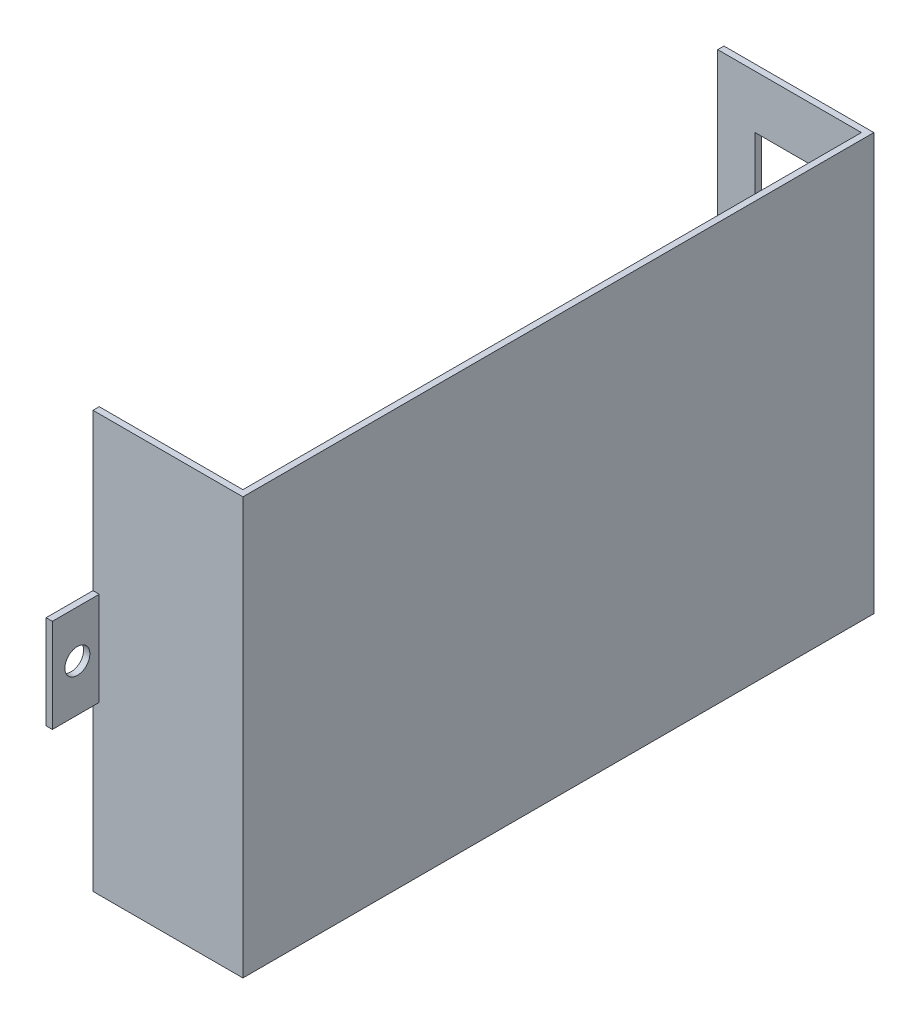
ISO-10303-21;
HEADER;
FILE_DESCRIPTION(('STEP AP214'),'2;1');
FILE_NAME('part.step','',(''),(''),'','','');
FILE_SCHEMA(('AUTOMOTIVE_DESIGN { 1 0 10303 214 1 1 1 1 }'));
ENDSEC;
DATA;
#1=APPLICATION_CONTEXT('core data for automotive mechanical design processes');
#2=APPLICATION_PROTOCOL_DEFINITION('international standard','automotive_design',2000,#1);
#3=PRODUCT_CONTEXT('',#1,'mechanical');
#4=PRODUCT('Part','Part','',(#3));
#5=PRODUCT_RELATED_PRODUCT_CATEGORY('part','',(#4));
#6=PRODUCT_DEFINITION_FORMATION('','',#4);
#7=PRODUCT_DEFINITION_CONTEXT('part definition',#1,'design');
#8=PRODUCT_DEFINITION('design','',#6,#7);
#9=PRODUCT_DEFINITION_SHAPE('','',#8);
#10=(LENGTH_UNIT() NAMED_UNIT(*) SI_UNIT(.MILLI.,.METRE.));
#11=(NAMED_UNIT(*) PLANE_ANGLE_UNIT() SI_UNIT($,.RADIAN.));
#12=(NAMED_UNIT(*) SI_UNIT($,.STERADIAN.) SOLID_ANGLE_UNIT());
#13=UNCERTAINTY_MEASURE_WITH_UNIT(LENGTH_MEASURE(1.E-05),#10,'distance_accuracy_value','');
#14=(GEOMETRIC_REPRESENTATION_CONTEXT(3) GLOBAL_UNCERTAINTY_ASSIGNED_CONTEXT((#13)) GLOBAL_UNIT_ASSIGNED_CONTEXT((#10,
#11,#12)) REPRESENTATION_CONTEXT('',''));
#15=CARTESIAN_POINT('',(0.,0.,0.));
#16=DIRECTION('',(0.,0.,1.));
#17=DIRECTION('',(1.,0.,0.));
#18=AXIS2_PLACEMENT_3D('',#15,#16,#17);
#19=CARTESIAN_POINT('',(2.5,-1.25,0.));
#20=DIRECTION('',(1.,0.,0.));
#21=DIRECTION('',(0.,1.,0.));
#22=AXIS2_PLACEMENT_3D('',#19,#20,#21);
#23=PLANE('',#22);
#24=CARTESIAN_POINT('',(2.5,-0.400000000000009,54.0000008642673));
#25=DIRECTION('',(-1.,0.,0.));
#26=DIRECTION('',(0.,0.,-1.));
#27=AXIS2_PLACEMENT_3D('',#24,#25,#26);
#28=CIRCLE('',#27,2.);
#29=CARTESIAN_POINT('',(2.5,-0.40000000000001,56.0000008642673));
#30=VERTEX_POINT('',#29);
#31=EDGE_CURVE('E454',#30,#30,#28,.T.);
#32=ORIENTED_EDGE('',*,*,#31,.F.);
#33=EDGE_LOOP('',(#32));
#34=FACE_BOUND('',#33,.T.);
#35=CARTESIAN_POINT('',(2.5,-0.400000000000009,-54.0000008642673));
#36=DIRECTION('',(-1.,0.,0.));
#37=DIRECTION('',(0.,0.,-1.));
#38=AXIS2_PLACEMENT_3D('',#35,#36,#37);
#39=CIRCLE('',#38,2.);
#40=CARTESIAN_POINT('',(2.5,-0.40000000000001,-52.0000008642673));
#41=VERTEX_POINT('',#40);
#42=EDGE_CURVE('E332',#41,#41,#39,.T.);
#43=ORIENTED_EDGE('',*,*,#42,.F.);
#44=EDGE_LOOP('',(#43));
#45=FACE_BOUND('',#44,.T.);
#46=DIRECTION('',(0.,1.,0.));
#47=VECTOR('',#46,1.);
#48=CARTESIAN_POINT('',(2.5,-17.925,-49.5));
#49=LINE('',#48,#47);
#50=CARTESIAN_POINT('',(2.5,-33.6,-49.5));
#51=VERTEX_POINT('',#50);
#52=CARTESIAN_POINT('',(2.5,32.1,-49.5));
#53=VERTEX_POINT('',#52);
#54=EDGE_CURVE('E258',#51,#53,#49,.T.);
#55=ORIENTED_EDGE('',*,*,#54,.T.);
#56=DIRECTION('',(0.,0.,1.));
#57=VECTOR('',#56,1.);
#58=CARTESIAN_POINT('',(2.5,32.1,-50.5));
#59=LINE('',#58,#57);
#60=CARTESIAN_POINT('',(2.5,32.1,-50.5));
#61=VERTEX_POINT('',#60);
#62=EDGE_CURVE('E354',#61,#53,#59,.T.);
#63=ORIENTED_EDGE('',*,*,#62,.F.);
#64=DIRECTION('',(0.,1.,0.));
#65=VECTOR('',#64,1.);
#66=CARTESIAN_POINT('',(2.5,-34.6,-50.5));
#67=LINE('',#66,#65);
#68=CARTESIAN_POINT('',(2.5,7.1,-50.5));
#69=VERTEX_POINT('',#68);
#70=EDGE_CURVE('E347',#69,#61,#67,.T.);
#71=ORIENTED_EDGE('',*,*,#70,.F.);
#72=DIRECTION('',(0.,0.,-1.));
#73=VECTOR('',#72,1.);
#74=CARTESIAN_POINT('',(2.5,7.1,-50.5));
#75=LINE('',#74,#73);
#76=CARTESIAN_POINT('',(2.5,7.1,-58.0000008642673));
#77=VERTEX_POINT('',#76);
#78=EDGE_CURVE('E327',#69,#77,#75,.T.);
#79=ORIENTED_EDGE('',*,*,#78,.T.);
#80=DIRECTION('',(0.,1.,0.));
#81=VECTOR('',#80,1.);
#82=CARTESIAN_POINT('',(2.5,-7.9,-58.0000008642673));
#83=LINE('',#82,#81);
#84=CARTESIAN_POINT('',(2.5,-7.9,-58.0000008642673));
#85=VERTEX_POINT('',#84);
#86=EDGE_CURVE('E474',#85,#77,#83,.T.);
#87=ORIENTED_EDGE('',*,*,#86,.F.);
#88=DIRECTION('',(0.,0.,-1.));
#89=VECTOR('',#88,1.);
#90=CARTESIAN_POINT('',(2.5,-7.9,-50.5));
#91=LINE('',#90,#89);
#92=CARTESIAN_POINT('',(2.5,-7.9,-50.5));
#93=VERTEX_POINT('',#92);
#94=EDGE_CURVE('E309',#93,#85,#91,.T.);
#95=ORIENTED_EDGE('',*,*,#94,.F.);
#96=DIRECTION('',(0.,1.,0.));
#97=VECTOR('',#96,1.);
#98=CARTESIAN_POINT('',(2.5,-34.6,-50.5));
#99=LINE('',#98,#97);
#100=CARTESIAN_POINT('',(2.5,-34.6,-50.5));
#101=VERTEX_POINT('',#100);
#102=EDGE_CURVE('E376',#101,#93,#99,.T.);
#103=ORIENTED_EDGE('',*,*,#102,.F.);
#104=DIRECTION('',(0.,0.,-1.));
#105=VECTOR('',#104,1.);
#106=CARTESIAN_POINT('',(2.5,-34.6,50.5));
#107=LINE('',#106,#105);
#108=CARTESIAN_POINT('',(2.5,-34.6,50.5));
#109=VERTEX_POINT('',#108);
#110=EDGE_CURVE('E28',#109,#101,#107,.T.);
#111=ORIENTED_EDGE('',*,*,#110,.F.);
#112=DIRECTION('',(0.,-1.,0.));
#113=VECTOR('',#112,1.);
#114=CARTESIAN_POINT('',(2.5,32.1,50.5));
#115=LINE('',#114,#113);
#116=CARTESIAN_POINT('',(2.5,-7.9,50.5));
#117=VERTEX_POINT('',#116);
#118=EDGE_CURVE('E518',#117,#109,#115,.T.);
#119=ORIENTED_EDGE('',*,*,#118,.F.);
#120=DIRECTION('',(0.,0.,-1.));
#121=VECTOR('',#120,1.);
#122=CARTESIAN_POINT('',(2.5,-7.9,58.0000008642673));
#123=LINE('',#122,#121);
#124=CARTESIAN_POINT('',(2.5,-7.9,58.0000008642673));
#125=VERTEX_POINT('',#124);
#126=EDGE_CURVE('E339',#125,#117,#123,.T.);
#127=ORIENTED_EDGE('',*,*,#126,.F.);
#128=DIRECTION('',(0.,-1.,0.));
#129=VECTOR('',#128,1.);
#130=CARTESIAN_POINT('',(2.5,7.1,58.0000008642673));
#131=LINE('',#130,#129);
#132=CARTESIAN_POINT('',(2.5,7.1,58.0000008642673));
#133=VERTEX_POINT('',#132);
#134=EDGE_CURVE('E402',#133,#125,#131,.T.);
#135=ORIENTED_EDGE('',*,*,#134,.F.);
#136=DIRECTION('',(0.,0.,1.));
#137=VECTOR('',#136,1.);
#138=CARTESIAN_POINT('',(2.5,7.1,50.5));
#139=LINE('',#138,#137);
#140=CARTESIAN_POINT('',(2.5,7.1,50.5));
#141=VERTEX_POINT('',#140);
#142=EDGE_CURVE('E433',#141,#133,#139,.T.);
#143=ORIENTED_EDGE('',*,*,#142,.F.);
#144=DIRECTION('',(0.,-1.,0.));
#145=VECTOR('',#144,1.);
#146=CARTESIAN_POINT('',(2.5,32.1,50.5));
#147=LINE('',#146,#145);
#148=CARTESIAN_POINT('',(2.5,32.1,50.5));
#149=VERTEX_POINT('',#148);
#150=EDGE_CURVE('E351',#149,#141,#147,.T.);
#151=ORIENTED_EDGE('',*,*,#150,.F.);
#152=DIRECTION('',(0.,0.,1.));
#153=VECTOR('',#152,1.);
#154=CARTESIAN_POINT('',(2.5,32.1,-50.5));
#155=LINE('',#154,#153);
#156=CARTESIAN_POINT('',(2.5,32.1,49.5));
#157=VERTEX_POINT('',#156);
#158=EDGE_CURVE('E507',#157,#149,#155,.T.);
#159=ORIENTED_EDGE('',*,*,#158,.F.);
#160=DIRECTION('',(0.,-1.,0.));
#161=VECTOR('',#160,1.);
#162=CARTESIAN_POINT('',(2.5,15.425,49.5));
#163=LINE('',#162,#161);
#164=CARTESIAN_POINT('',(2.5,-33.6,49.5));
#165=VERTEX_POINT('',#164);
#166=EDGE_CURVE('E279',#157,#165,#163,.T.);
#167=ORIENTED_EDGE('',*,*,#166,.T.);
#168=DIRECTION('',(0.,0.,-1.));
#169=VECTOR('',#168,1.);
#170=CARTESIAN_POINT('',(2.5,-33.6,25.25));
#171=LINE('',#170,#169);
#172=EDGE_CURVE('E275',#165,#51,#171,.T.);
#173=ORIENTED_EDGE('',*,*,#172,.T.);
#174=EDGE_LOOP('',(#55,#63,#71,#79,#87,#95,#103,#111,#119,#127,#135,#143,#151,#159,#167,#173));
#175=FACE_BOUND('',#174,.T.);
#176=ADVANCED_FACE('F17',(#34,#45,#175),#23,.F.);
#177=CARTESIAN_POINT('',(26.5,-1.25,0.));
#178=DIRECTION('',(1.,0.,0.));
#179=DIRECTION('',(0.,1.,0.));
#180=AXIS2_PLACEMENT_3D('',#177,#178,#179);
#181=PLANE('',#180);
#182=DIRECTION('',(0.,1.,0.));
#183=VECTOR('',#182,1.);
#184=CARTESIAN_POINT('',(26.5,-34.6,-50.5));
#185=LINE('',#184,#183);
#186=CARTESIAN_POINT('',(26.5,-34.6,-50.5));
#187=VERTEX_POINT('',#186);
#188=CARTESIAN_POINT('',(26.5,32.1,-50.5));
#189=VERTEX_POINT('',#188);
#190=EDGE_CURVE('E377',#187,#189,#185,.T.);
#191=ORIENTED_EDGE('',*,*,#190,.T.);
#192=DIRECTION('',(0.,0.,1.));
#193=VECTOR('',#192,1.);
#194=CARTESIAN_POINT('',(26.5,32.1,-50.5));
#195=LINE('',#194,#193);
#196=CARTESIAN_POINT('',(26.5,32.1,50.5));
#197=VERTEX_POINT('',#196);
#198=EDGE_CURVE('E357',#189,#197,#195,.T.);
#199=ORIENTED_EDGE('',*,*,#198,.T.);
#200=DIRECTION('',(0.,-1.,0.));
#201=VECTOR('',#200,1.);
#202=CARTESIAN_POINT('',(26.5,32.1,50.5));
#203=LINE('',#202,#201);
#204=CARTESIAN_POINT('',(26.5,-34.6,50.5));
#205=VERTEX_POINT('',#204);
#206=EDGE_CURVE('E352',#197,#205,#203,.T.);
#207=ORIENTED_EDGE('',*,*,#206,.T.);
#208=DIRECTION('',(0.,0.,-1.));
#209=VECTOR('',#208,1.);
#210=CARTESIAN_POINT('',(26.5,-34.6,50.5));
#211=LINE('',#210,#209);
#212=EDGE_CURVE('E11',#205,#187,#211,.T.);
#213=ORIENTED_EDGE('',*,*,#212,.T.);
#214=EDGE_LOOP('',(#191,#199,#207,#213));
#215=FACE_BOUND('',#214,.T.);
#216=ADVANCED_FACE('F626',(#215),#181,.T.);
#217=CARTESIAN_POINT('',(2.5,-34.6,50.5));
#218=DIRECTION('',(0.,-1.,0.));
#219=DIRECTION('',(0.,0.,-1.));
#220=AXIS2_PLACEMENT_3D('',#217,#218,#219);
#221=PLANE('',#220);
#222=CARTESIAN_POINT('',(16.5,-34.6,-45.5));
#223=DIRECTION('',(0.,1.,0.));
#224=DIRECTION('',(1.,0.,0.));
#225=AXIS2_PLACEMENT_3D('',#222,#223,#224);
#226=CIRCLE('',#225,1.5);
#227=CARTESIAN_POINT('',(15.,-34.6,-45.5));
#228=VERTEX_POINT('',#227);
#229=EDGE_CURVE('E371',#228,#228,#226,.T.);
#230=ORIENTED_EDGE('',*,*,#229,.T.);
#231=EDGE_LOOP('',(#230));
#232=FACE_BOUND('',#231,.T.);
#233=CARTESIAN_POINT('',(11.5,-34.6,-45.5));
#234=DIRECTION('',(0.,1.,0.));
#235=DIRECTION('',(1.,0.,0.));
#236=AXIS2_PLACEMENT_3D('',#233,#234,#235);
#237=CIRCLE('',#236,1.5);
#238=CARTESIAN_POINT('',(10.,-34.6,-45.5));
#239=VERTEX_POINT('',#238);
#240=EDGE_CURVE('E425',#239,#239,#237,.T.);
#241=ORIENTED_EDGE('',*,*,#240,.T.);
#242=EDGE_LOOP('',(#241));
#243=FACE_BOUND('',#242,.T.);
#244=DIRECTION('',(0.,0.,-1.));
#245=VECTOR('',#244,1.);
#246=CARTESIAN_POINT('',(16.,-34.6,48.));
#247=LINE('',#246,#245);
#248=CARTESIAN_POINT('',(16.,-34.6,45.5));
#249=VERTEX_POINT('',#248);
#250=CARTESIAN_POINT('',(16.,-34.6,-39.5));
#251=VERTEX_POINT('',#250);
#252=EDGE_CURVE('E365',#249,#251,#247,.T.);
#253=ORIENTED_EDGE('',*,*,#252,.T.);
#254=DIRECTION('',(-1.,0.,0.));
#255=VECTOR('',#254,1.);
#256=CARTESIAN_POINT('',(9.25,-34.6,-39.5));
#257=LINE('',#256,#255);
#258=CARTESIAN_POINT('',(8.5,-34.6,-39.5));
#259=VERTEX_POINT('',#258);
#260=EDGE_CURVE('E296',#251,#259,#257,.T.);
#261=ORIENTED_EDGE('',*,*,#260,.T.);
#262=DIRECTION('',(0.,0.,1.));
#263=VECTOR('',#262,1.);
#264=CARTESIAN_POINT('',(8.5,-34.6,5.5));
#265=LINE('',#264,#263);
#266=CARTESIAN_POINT('',(8.5,-34.6,45.5));
#267=VERTEX_POINT('',#266);
#268=EDGE_CURVE('E316',#259,#267,#265,.T.);
#269=ORIENTED_EDGE('',*,*,#268,.T.);
#270=DIRECTION('',(1.,0.,0.));
#271=VECTOR('',#270,1.);
#272=CARTESIAN_POINT('',(5.5,-34.6,45.5));
#273=LINE('',#272,#271);
#274=EDGE_CURVE('E417',#267,#249,#273,.T.);
#275=ORIENTED_EDGE('',*,*,#274,.T.);
#276=EDGE_LOOP('',(#253,#261,#269,#275));
#277=FACE_BOUND('',#276,.T.);
#278=ORIENTED_EDGE('',*,*,#110,.T.);
#279=DIRECTION('',(1.,0.,0.));
#280=VECTOR('',#279,1.);
#281=CARTESIAN_POINT('',(2.5,-34.6,-50.5));
#282=LINE('',#281,#280);
#283=EDGE_CURVE('E372',#101,#187,#282,.T.);
#284=ORIENTED_EDGE('',*,*,#283,.T.);
#285=ORIENTED_EDGE('',*,*,#212,.F.);
#286=DIRECTION('',(1.,0.,0.));
#287=VECTOR('',#286,1.);
#288=CARTESIAN_POINT('',(2.5,-34.6,50.5));
#289=LINE('',#288,#287);
#290=EDGE_CURVE('E459',#109,#205,#289,.T.);
#291=ORIENTED_EDGE('',*,*,#290,.F.);
#292=EDGE_LOOP('',(#278,#284,#285,#291));
#293=FACE_BOUND('',#292,.T.);
#294=ADVANCED_FACE('F633',(#232,#243,#277,#293),#221,.T.);
#295=CARTESIAN_POINT('',(2.5,32.1,-50.5));
#296=DIRECTION('',(0.,1.,0.));
#297=DIRECTION('',(1.,0.,0.));
#298=AXIS2_PLACEMENT_3D('',#295,#296,#297);
#299=PLANE('',#298);
#300=DIRECTION('',(1.,0.,0.));
#301=VECTOR('',#300,1.);
#302=CARTESIAN_POINT('',(2.5,32.1,-49.5));
#303=LINE('',#302,#301);
#304=CARTESIAN_POINT('',(25.5,32.1,-49.5));
#305=VERTEX_POINT('',#304);
#306=EDGE_CURVE('E264',#53,#305,#303,.T.);
#307=ORIENTED_EDGE('',*,*,#306,.T.);
#308=DIRECTION('',(0.,0.,1.));
#309=VECTOR('',#308,1.);
#310=CARTESIAN_POINT('',(25.5,32.1,-25.25));
#311=LINE('',#310,#309);
#312=CARTESIAN_POINT('',(25.5,32.1,49.5));
#313=VERTEX_POINT('',#312);
#314=EDGE_CURVE('E42',#305,#313,#311,.T.);
#315=ORIENTED_EDGE('',*,*,#314,.T.);
#316=DIRECTION('',(-1.,0.,0.));
#317=VECTOR('',#316,1.);
#318=CARTESIAN_POINT('',(2.5,32.1,49.5));
#319=LINE('',#318,#317);
#320=EDGE_CURVE('E481',#313,#157,#319,.T.);
#321=ORIENTED_EDGE('',*,*,#320,.T.);
#322=ORIENTED_EDGE('',*,*,#158,.T.);
#323=DIRECTION('',(1.,0.,0.));
#324=VECTOR('',#323,1.);
#325=CARTESIAN_POINT('',(2.5,32.1,50.5));
#326=LINE('',#325,#324);
#327=EDGE_CURVE('E348',#149,#197,#326,.T.);
#328=ORIENTED_EDGE('',*,*,#327,.T.);
#329=ORIENTED_EDGE('',*,*,#198,.F.);
#330=DIRECTION('',(1.,0.,0.));
#331=VECTOR('',#330,1.);
#332=CARTESIAN_POINT('',(2.5,32.1,-50.5));
#333=LINE('',#332,#331);
#334=EDGE_CURVE('E409',#61,#189,#333,.T.);
#335=ORIENTED_EDGE('',*,*,#334,.F.);
#336=ORIENTED_EDGE('',*,*,#62,.T.);
#337=EDGE_LOOP('',(#307,#315,#321,#322,#328,#329,#335,#336));
#338=FACE_BOUND('',#337,.T.);
#339=ADVANCED_FACE('F623',(#338),#299,.T.);
#340=CARTESIAN_POINT('',(25.5,-1.25,0.));
#341=DIRECTION('',(1.,0.,0.));
#342=DIRECTION('',(0.,1.,0.));
#343=AXIS2_PLACEMENT_3D('',#340,#341,#342);
#344=PLANE('',#343);
#345=DIRECTION('',(0.,1.,0.));
#346=VECTOR('',#345,1.);
#347=CARTESIAN_POINT('',(25.5,-17.925,-49.5));
#348=LINE('',#347,#346);
#349=CARTESIAN_POINT('',(25.5,-33.6,-49.5));
#350=VERTEX_POINT('',#349);
#351=EDGE_CURVE('E268',#350,#305,#348,.T.);
#352=ORIENTED_EDGE('',*,*,#351,.F.);
#353=DIRECTION('',(0.,0.,-1.));
#354=VECTOR('',#353,1.);
#355=CARTESIAN_POINT('',(25.5,-33.6,25.25));
#356=LINE('',#355,#354);
#357=CARTESIAN_POINT('',(25.5,-33.6,49.5));
#358=VERTEX_POINT('',#357);
#359=EDGE_CURVE('E277',#358,#350,#356,.T.);
#360=ORIENTED_EDGE('',*,*,#359,.F.);
#361=DIRECTION('',(0.,-1.,0.));
#362=VECTOR('',#361,1.);
#363=CARTESIAN_POINT('',(25.5,15.425,49.5));
#364=LINE('',#363,#362);
#365=EDGE_CURVE('E269',#313,#358,#364,.T.);
#366=ORIENTED_EDGE('',*,*,#365,.F.);
#367=ORIENTED_EDGE('',*,*,#314,.F.);
#368=EDGE_LOOP('',(#352,#360,#366,#367));
#369=FACE_BOUND('',#368,.T.);
#370=ADVANCED_FACE('F19',(#369),#344,.F.);
#371=CARTESIAN_POINT('',(2.5,-34.6,-49.5));
#372=DIRECTION('',(0.,0.,-1.));
#373=DIRECTION('',(0.,-1.,0.));
#374=AXIS2_PLACEMENT_3D('',#371,#372,#373);
#375=PLANE('',#374);
#376=DIRECTION('',(-1.,0.,0.));
#377=VECTOR('',#376,1.);
#378=CARTESIAN_POINT('',(10.5,9.6,-49.5));
#379=LINE('',#378,#377);
#380=CARTESIAN_POINT('',(20.5,9.6,-49.5));
#381=VERTEX_POINT('',#380);
#382=CARTESIAN_POINT('',(18.5,9.6,-49.5));
#383=VERTEX_POINT('',#382);
#384=EDGE_CURVE('E424',#381,#383,#379,.T.);
#385=ORIENTED_EDGE('',*,*,#384,.T.);
#386=DIRECTION('',(0.,-1.,0.));
#387=VECTOR('',#386,1.);
#388=CARTESIAN_POINT('',(18.5,-23.,-49.5));
#389=LINE('',#388,#387);
#390=CARTESIAN_POINT('',(18.5,-11.4,-49.5));
#391=VERTEX_POINT('',#390);
#392=EDGE_CURVE('E314',#383,#391,#389,.T.);
#393=ORIENTED_EDGE('',*,*,#392,.T.);
#394=DIRECTION('',(-1.,0.,0.));
#395=VECTOR('',#394,1.);
#396=CARTESIAN_POINT('',(5.5,-11.4,-49.5));
#397=LINE('',#396,#395);
#398=CARTESIAN_POINT('',(8.5,-11.4,-49.5));
#399=VERTEX_POINT('',#398);
#400=EDGE_CURVE('E532',#391,#399,#397,.T.);
#401=ORIENTED_EDGE('',*,*,#400,.T.);
#402=DIRECTION('',(0.,1.,0.));
#403=VECTOR('',#402,1.);
#404=CARTESIAN_POINT('',(8.5,-5.5,-49.5));
#405=LINE('',#404,#403);
#406=CARTESIAN_POINT('',(8.5,23.6,-49.5));
#407=VERTEX_POINT('',#406);
#408=EDGE_CURVE('E551',#399,#407,#405,.T.);
#409=ORIENTED_EDGE('',*,*,#408,.T.);
#410=DIRECTION('',(1.,0.,0.));
#411=VECTOR('',#410,1.);
#412=CARTESIAN_POINT('',(11.5,23.6,-49.5));
#413=LINE('',#412,#411);
#414=CARTESIAN_POINT('',(20.5,23.6,-49.5));
#415=VERTEX_POINT('',#414);
#416=EDGE_CURVE('E387',#407,#415,#413,.T.);
#417=ORIENTED_EDGE('',*,*,#416,.T.);
#418=DIRECTION('',(0.,-1.,0.));
#419=VECTOR('',#418,1.);
#420=CARTESIAN_POINT('',(20.5,-12.5,-49.5));
#421=LINE('',#420,#419);
#422=EDGE_CURVE('E391',#415,#381,#421,.T.);
#423=ORIENTED_EDGE('',*,*,#422,.T.);
#424=EDGE_LOOP('',(#385,#393,#401,#409,#417,#423));
#425=FACE_BOUND('',#424,.T.);
#426=ORIENTED_EDGE('',*,*,#54,.F.);
#427=DIRECTION('',(1.,0.,0.));
#428=VECTOR('',#427,1.);
#429=CARTESIAN_POINT('',(2.5,-33.6,-49.5));
#430=LINE('',#429,#428);
#431=EDGE_CURVE('E262',#51,#350,#430,.T.);
#432=ORIENTED_EDGE('',*,*,#431,.T.);
#433=ORIENTED_EDGE('',*,*,#351,.T.);
#434=ORIENTED_EDGE('',*,*,#306,.F.);
#435=EDGE_LOOP('',(#426,#432,#433,#434));
#436=FACE_BOUND('',#435,.T.);
#437=ADVANCED_FACE('F260',(#425,#436),#375,.F.);
#438=CARTESIAN_POINT('',(2.5,32.1,49.5));
#439=DIRECTION('',(0.,0.,1.));
#440=DIRECTION('',(1.,0.,0.));
#441=AXIS2_PLACEMENT_3D('',#438,#439,#440);
#442=PLANE('',#441);
#443=ORIENTED_EDGE('',*,*,#166,.F.);
#444=ORIENTED_EDGE('',*,*,#320,.F.);
#445=ORIENTED_EDGE('',*,*,#365,.T.);
#446=DIRECTION('',(1.,0.,0.));
#447=VECTOR('',#446,1.);
#448=CARTESIAN_POINT('',(2.5,-33.6,49.5));
#449=LINE('',#448,#447);
#450=EDGE_CURVE('E284',#165,#358,#449,.T.);
#451=ORIENTED_EDGE('',*,*,#450,.F.);
#452=EDGE_LOOP('',(#443,#444,#445,#451));
#453=FACE_BOUND('',#452,.T.);
#454=ADVANCED_FACE('F613',(#453),#442,.F.);
#455=CARTESIAN_POINT('',(2.5,-33.6,50.5));
#456=DIRECTION('',(0.,-1.,0.));
#457=DIRECTION('',(0.,0.,-1.));
#458=AXIS2_PLACEMENT_3D('',#455,#456,#457);
#459=PLANE('',#458);
#460=CARTESIAN_POINT('',(16.5,-33.6,-45.5));
#461=DIRECTION('',(0.,-1.,0.));
#462=DIRECTION('',(1.,0.,0.));
#463=AXIS2_PLACEMENT_3D('',#460,#461,#462);
#464=CIRCLE('',#463,1.5);
#465=CARTESIAN_POINT('',(15.,-33.6,-45.5));
#466=VERTEX_POINT('',#465);
#467=EDGE_CURVE('E285',#466,#466,#464,.T.);
#468=ORIENTED_EDGE('',*,*,#467,.T.);
#469=EDGE_LOOP('',(#468));
#470=FACE_BOUND('',#469,.T.);
#471=CARTESIAN_POINT('',(11.5,-33.6,-45.5));
#472=DIRECTION('',(0.,-1.,0.));
#473=DIRECTION('',(1.,0.,0.));
#474=AXIS2_PLACEMENT_3D('',#471,#472,#473);
#475=CIRCLE('',#474,1.5);
#476=CARTESIAN_POINT('',(10.,-33.6,-45.5));
#477=VERTEX_POINT('',#476);
#478=EDGE_CURVE('E467',#477,#477,#475,.T.);
#479=ORIENTED_EDGE('',*,*,#478,.T.);
#480=EDGE_LOOP('',(#479));
#481=FACE_BOUND('',#480,.T.);
#482=DIRECTION('',(0.,0.,1.));
#483=VECTOR('',#482,1.);
#484=CARTESIAN_POINT('',(16.,-33.6,48.));
#485=LINE('',#484,#483);
#486=CARTESIAN_POINT('',(16.,-33.6,-39.5));
#487=VERTEX_POINT('',#486);
#488=CARTESIAN_POINT('',(16.,-33.6,45.5));
#489=VERTEX_POINT('',#488);
#490=EDGE_CURVE('E364',#487,#489,#485,.T.);
#491=ORIENTED_EDGE('',*,*,#490,.T.);
#492=DIRECTION('',(-1.,0.,0.));
#493=VECTOR('',#492,1.);
#494=CARTESIAN_POINT('',(5.5,-33.6,45.5));
#495=LINE('',#494,#493);
#496=CARTESIAN_POINT('',(8.5,-33.6,45.5));
#497=VERTEX_POINT('',#496);
#498=EDGE_CURVE('E320',#489,#497,#495,.T.);
#499=ORIENTED_EDGE('',*,*,#498,.T.);
#500=DIRECTION('',(0.,0.,-1.));
#501=VECTOR('',#500,1.);
#502=CARTESIAN_POINT('',(8.5,-33.6,5.5));
#503=LINE('',#502,#501);
#504=CARTESIAN_POINT('',(8.5,-33.6,-39.5));
#505=VERTEX_POINT('',#504);
#506=EDGE_CURVE('E443',#497,#505,#503,.T.);
#507=ORIENTED_EDGE('',*,*,#506,.T.);
#508=DIRECTION('',(1.,0.,0.));
#509=VECTOR('',#508,1.);
#510=CARTESIAN_POINT('',(9.25,-33.6,-39.5));
#511=LINE('',#510,#509);
#512=EDGE_CURVE('E21',#505,#487,#511,.T.);
#513=ORIENTED_EDGE('',*,*,#512,.T.);
#514=EDGE_LOOP('',(#491,#499,#507,#513));
#515=FACE_BOUND('',#514,.T.);
#516=ORIENTED_EDGE('',*,*,#172,.F.);
#517=ORIENTED_EDGE('',*,*,#450,.T.);
#518=ORIENTED_EDGE('',*,*,#359,.T.);
#519=ORIENTED_EDGE('',*,*,#431,.F.);
#520=EDGE_LOOP('',(#516,#517,#518,#519));
#521=FACE_BOUND('',#520,.T.);
#522=ADVANCED_FACE('F273',(#470,#481,#515,#521),#459,.F.);
#523=CARTESIAN_POINT('',(16.5,-34.6,-45.5));
#524=DIRECTION('',(0.,1.,0.));
#525=DIRECTION('',(1.,0.,0.));
#526=AXIS2_PLACEMENT_3D('',#523,#524,#525);
#527=CYLINDRICAL_SURFACE('',#526,1.5);
#528=ORIENTED_EDGE('',*,*,#229,.F.);
#529=DIRECTION('',(0.,1.,0.));
#530=VECTOR('',#529,1.);
#531=CARTESIAN_POINT('',(15.,-34.6,-45.5));
#532=LINE('',#531,#530);
#533=EDGE_CURVE('E293',#228,#466,#532,.T.);
#534=ORIENTED_EDGE('',*,*,#533,.T.);
#535=ORIENTED_EDGE('',*,*,#467,.F.);
#536=ORIENTED_EDGE('',*,*,#533,.F.);
#537=EDGE_LOOP('',(#528,#534,#535,#536));
#538=FACE_BOUND('',#537,.T.);
#539=ADVANCED_FACE('F654',(#538),#527,.F.);
#540=CARTESIAN_POINT('',(11.5,-34.6,-45.5));
#541=DIRECTION('',(0.,1.,0.));
#542=DIRECTION('',(1.,0.,0.));
#543=AXIS2_PLACEMENT_3D('',#540,#541,#542);
#544=CYLINDRICAL_SURFACE('',#543,1.5);
#545=ORIENTED_EDGE('',*,*,#240,.F.);
#546=DIRECTION('',(0.,1.,0.));
#547=VECTOR('',#546,1.);
#548=CARTESIAN_POINT('',(10.,-34.6,-45.5));
#549=LINE('',#548,#547);
#550=EDGE_CURVE('E429',#239,#477,#549,.T.);
#551=ORIENTED_EDGE('',*,*,#550,.T.);
#552=ORIENTED_EDGE('',*,*,#478,.F.);
#553=ORIENTED_EDGE('',*,*,#550,.F.);
#554=EDGE_LOOP('',(#545,#551,#552,#553));
#555=FACE_BOUND('',#554,.T.);
#556=ADVANCED_FACE('F684',(#555),#544,.F.);
#557=CARTESIAN_POINT('',(16.,-34.6,-39.5));
#558=DIRECTION('',(0.,0.,-1.));
#559=DIRECTION('',(0.,-1.,0.));
#560=AXIS2_PLACEMENT_3D('',#557,#558,#559);
#561=PLANE('',#560);
#562=ORIENTED_EDGE('',*,*,#260,.F.);
#563=DIRECTION('',(0.,1.,0.));
#564=VECTOR('',#563,1.);
#565=CARTESIAN_POINT('',(16.,-34.6,-39.5));
#566=LINE('',#565,#564);
#567=EDGE_CURVE('E413',#251,#487,#566,.T.);
#568=ORIENTED_EDGE('',*,*,#567,.T.);
#569=ORIENTED_EDGE('',*,*,#512,.F.);
#570=DIRECTION('',(0.,1.,0.));
#571=VECTOR('',#570,1.);
#572=CARTESIAN_POINT('',(8.5,-34.6,-39.5));
#573=LINE('',#572,#571);
#574=EDGE_CURVE('E319',#259,#505,#573,.T.);
#575=ORIENTED_EDGE('',*,*,#574,.F.);
#576=EDGE_LOOP('',(#562,#568,#569,#575));
#577=FACE_BOUND('',#576,.T.);
#578=ADVANCED_FACE('F696',(#577),#561,.F.);
#579=CARTESIAN_POINT('',(8.5,-34.6,-39.5));
#580=DIRECTION('',(-1.,0.,0.));
#581=DIRECTION('',(0.,0.,1.));
#582=AXIS2_PLACEMENT_3D('',#579,#580,#581);
#583=PLANE('',#582);
#584=ORIENTED_EDGE('',*,*,#268,.F.);
#585=ORIENTED_EDGE('',*,*,#574,.T.);
#586=ORIENTED_EDGE('',*,*,#506,.F.);
#587=DIRECTION('',(0.,1.,0.));
#588=VECTOR('',#587,1.);
#589=CARTESIAN_POINT('',(8.5,-34.6,45.5));
#590=LINE('',#589,#588);
#591=EDGE_CURVE('E381',#267,#497,#590,.T.);
#592=ORIENTED_EDGE('',*,*,#591,.F.);
#593=EDGE_LOOP('',(#584,#585,#586,#592));
#594=FACE_BOUND('',#593,.T.);
#595=ADVANCED_FACE('F892',(#594),#583,.F.);
#596=CARTESIAN_POINT('',(8.5,-34.6,45.5));
#597=DIRECTION('',(0.,0.,1.));
#598=DIRECTION('',(1.,0.,0.));
#599=AXIS2_PLACEMENT_3D('',#596,#597,#598);
#600=PLANE('',#599);
#601=ORIENTED_EDGE('',*,*,#274,.F.);
#602=ORIENTED_EDGE('',*,*,#591,.T.);
#603=ORIENTED_EDGE('',*,*,#498,.F.);
#604=DIRECTION('',(0.,1.,0.));
#605=VECTOR('',#604,1.);
#606=CARTESIAN_POINT('',(16.,-34.6,45.5));
#607=LINE('',#606,#605);
#608=EDGE_CURVE('E360',#249,#489,#607,.T.);
#609=ORIENTED_EDGE('',*,*,#608,.F.);
#610=EDGE_LOOP('',(#601,#602,#603,#609));
#611=FACE_BOUND('',#610,.T.);
#612=ADVANCED_FACE('F666',(#611),#600,.F.);
#613=CARTESIAN_POINT('',(16.,-34.6,45.5));
#614=DIRECTION('',(1.,0.,0.));
#615=DIRECTION('',(0.,1.,0.));
#616=AXIS2_PLACEMENT_3D('',#613,#614,#615);
#617=PLANE('',#616);
#618=ORIENTED_EDGE('',*,*,#252,.F.);
#619=ORIENTED_EDGE('',*,*,#608,.T.);
#620=ORIENTED_EDGE('',*,*,#490,.F.);
#621=ORIENTED_EDGE('',*,*,#567,.F.);
#622=EDGE_LOOP('',(#618,#619,#620,#621));
#623=FACE_BOUND('',#622,.T.);
#624=ADVANCED_FACE('F663',(#623),#617,.F.);
#625=CARTESIAN_POINT('',(20.5,9.6,-50.5));
#626=DIRECTION('',(1.,0.,0.));
#627=DIRECTION('',(0.,1.,0.));
#628=AXIS2_PLACEMENT_3D('',#625,#626,#627);
#629=PLANE('',#628);
#630=DIRECTION('',(0.,1.,0.));
#631=VECTOR('',#630,1.);
#632=CARTESIAN_POINT('',(20.5,-12.5,-50.5));
#633=LINE('',#632,#631);
#634=CARTESIAN_POINT('',(20.5,9.6,-50.5));
#635=VERTEX_POINT('',#634);
#636=CARTESIAN_POINT('',(20.5,23.6,-50.5));
#637=VERTEX_POINT('',#636);
#638=EDGE_CURVE('E386',#635,#637,#633,.T.);
#639=ORIENTED_EDGE('',*,*,#638,.F.);
#640=DIRECTION('',(0.,0.,1.));
#641=VECTOR('',#640,1.);
#642=CARTESIAN_POINT('',(20.5,9.6,-50.5));
#643=LINE('',#642,#641);
#644=EDGE_CURVE('E315',#635,#381,#643,.T.);
#645=ORIENTED_EDGE('',*,*,#644,.T.);
#646=ORIENTED_EDGE('',*,*,#422,.F.);
#647=DIRECTION('',(0.,0.,1.));
#648=VECTOR('',#647,1.);
#649=CARTESIAN_POINT('',(20.5,23.6,-50.5));
#650=LINE('',#649,#648);
#651=EDGE_CURVE('E392',#637,#415,#650,.T.);
#652=ORIENTED_EDGE('',*,*,#651,.F.);
#653=EDGE_LOOP('',(#639,#645,#646,#652));
#654=FACE_BOUND('',#653,.T.);
#655=ADVANCED_FACE('F596',(#654),#629,.F.);
#656=CARTESIAN_POINT('',(20.5,23.6,-50.5));
#657=DIRECTION('',(0.,1.,0.));
#658=DIRECTION('',(1.,0.,0.));
#659=AXIS2_PLACEMENT_3D('',#656,#657,#658);
#660=PLANE('',#659);
#661=DIRECTION('',(-1.,0.,0.));
#662=VECTOR('',#661,1.);
#663=CARTESIAN_POINT('',(11.5,23.6,-50.5));
#664=LINE('',#663,#662);
#665=CARTESIAN_POINT('',(8.5,23.6,-50.5));
#666=VERTEX_POINT('',#665);
#667=EDGE_CURVE('E326',#637,#666,#664,.T.);
#668=ORIENTED_EDGE('',*,*,#667,.F.);
#669=ORIENTED_EDGE('',*,*,#651,.T.);
#670=ORIENTED_EDGE('',*,*,#416,.F.);
#671=DIRECTION('',(0.,0.,1.));
#672=VECTOR('',#671,1.);
#673=CARTESIAN_POINT('',(8.5,23.6,-50.5));
#674=LINE('',#673,#672);
#675=EDGE_CURVE('E554',#666,#407,#674,.T.);
#676=ORIENTED_EDGE('',*,*,#675,.F.);
#677=EDGE_LOOP('',(#668,#669,#670,#676));
#678=FACE_BOUND('',#677,.T.);
#679=ADVANCED_FACE('F599',(#678),#660,.F.);
#680=CARTESIAN_POINT('',(8.5,23.6,-50.5));
#681=DIRECTION('',(-1.,0.,0.));
#682=DIRECTION('',(0.,0.,1.));
#683=AXIS2_PLACEMENT_3D('',#680,#681,#682);
#684=PLANE('',#683);
#685=DIRECTION('',(0.,-1.,0.));
#686=VECTOR('',#685,1.);
#687=CARTESIAN_POINT('',(8.5,-5.5,-50.5));
#688=LINE('',#687,#686);
#689=CARTESIAN_POINT('',(8.5,-11.4,-50.5));
#690=VERTEX_POINT('',#689);
#691=EDGE_CURVE('E321',#666,#690,#688,.T.);
#692=ORIENTED_EDGE('',*,*,#691,.F.);
#693=ORIENTED_EDGE('',*,*,#675,.T.);
#694=ORIENTED_EDGE('',*,*,#408,.F.);
#695=DIRECTION('',(0.,0.,1.));
#696=VECTOR('',#695,1.);
#697=CARTESIAN_POINT('',(8.5,-11.4,-50.5));
#698=LINE('',#697,#696);
#699=EDGE_CURVE('E343',#690,#399,#698,.T.);
#700=ORIENTED_EDGE('',*,*,#699,.F.);
#701=EDGE_LOOP('',(#692,#693,#694,#700));
#702=FACE_BOUND('',#701,.T.);
#703=ADVANCED_FACE('F600',(#702),#684,.F.);
#704=CARTESIAN_POINT('',(8.5,-11.4,-50.5));
#705=DIRECTION('',(0.,-1.,0.));
#706=DIRECTION('',(0.,0.,-1.));
#707=AXIS2_PLACEMENT_3D('',#704,#705,#706);
#708=PLANE('',#707);
#709=DIRECTION('',(1.,0.,0.));
#710=VECTOR('',#709,1.);
#711=CARTESIAN_POINT('',(5.5,-11.4,-50.5));
#712=LINE('',#711,#710);
#713=CARTESIAN_POINT('',(18.5,-11.4,-50.5));
#714=VERTEX_POINT('',#713);
#715=EDGE_CURVE('E325',#690,#714,#712,.T.);
#716=ORIENTED_EDGE('',*,*,#715,.F.);
#717=ORIENTED_EDGE('',*,*,#699,.T.);
#718=ORIENTED_EDGE('',*,*,#400,.F.);
#719=DIRECTION('',(0.,0.,1.));
#720=VECTOR('',#719,1.);
#721=CARTESIAN_POINT('',(18.5,-11.4,-50.5));
#722=LINE('',#721,#720);
#723=EDGE_CURVE('E310',#714,#391,#722,.T.);
#724=ORIENTED_EDGE('',*,*,#723,.F.);
#725=EDGE_LOOP('',(#716,#717,#718,#724));
#726=FACE_BOUND('',#725,.T.);
#727=ADVANCED_FACE('F604',(#726),#708,.F.);
#728=CARTESIAN_POINT('',(18.5,-11.4,-50.5));
#729=DIRECTION('',(1.,0.,0.));
#730=DIRECTION('',(0.,-1.,0.));
#731=AXIS2_PLACEMENT_3D('',#728,#729,#730);
#732=PLANE('',#731);
#733=DIRECTION('',(0.,1.,0.));
#734=VECTOR('',#733,1.);
#735=CARTESIAN_POINT('',(18.5,-23.,-50.5));
#736=LINE('',#735,#734);
#737=CARTESIAN_POINT('',(18.5,9.6,-50.5));
#738=VERTEX_POINT('',#737);
#739=EDGE_CURVE('E401',#714,#738,#736,.T.);
#740=ORIENTED_EDGE('',*,*,#739,.F.);
#741=ORIENTED_EDGE('',*,*,#723,.T.);
#742=ORIENTED_EDGE('',*,*,#392,.F.);
#743=DIRECTION('',(0.,0.,1.));
#744=VECTOR('',#743,1.);
#745=CARTESIAN_POINT('',(18.5,9.6,-50.5));
#746=LINE('',#745,#744);
#747=EDGE_CURVE('E395',#738,#383,#746,.T.);
#748=ORIENTED_EDGE('',*,*,#747,.F.);
#749=EDGE_LOOP('',(#740,#741,#742,#748));
#750=FACE_BOUND('',#749,.T.);
#751=ADVANCED_FACE('F607',(#750),#732,.F.);
#752=CARTESIAN_POINT('',(18.5,9.6,-50.5));
#753=DIRECTION('',(0.,-1.,0.));
#754=DIRECTION('',(0.,0.,-1.));
#755=AXIS2_PLACEMENT_3D('',#752,#753,#754);
#756=PLANE('',#755);
#757=DIRECTION('',(1.,0.,0.));
#758=VECTOR('',#757,1.);
#759=CARTESIAN_POINT('',(10.5,9.6,-50.5));
#760=LINE('',#759,#758);
#761=EDGE_CURVE('E382',#738,#635,#760,.T.);
#762=ORIENTED_EDGE('',*,*,#761,.F.);
#763=ORIENTED_EDGE('',*,*,#747,.T.);
#764=ORIENTED_EDGE('',*,*,#384,.F.);
#765=ORIENTED_EDGE('',*,*,#644,.F.);
#766=EDGE_LOOP('',(#762,#763,#764,#765));
#767=FACE_BOUND('',#766,.T.);
#768=ADVANCED_FACE('F611',(#767),#756,.F.);
#769=CARTESIAN_POINT('',(2.5,32.1,50.5));
#770=DIRECTION('',(0.,0.,1.));
#771=DIRECTION('',(1.,0.,0.));
#772=AXIS2_PLACEMENT_3D('',#769,#770,#771);
#773=PLANE('',#772);
#774=DIRECTION('',(1.,0.,0.));
#775=VECTOR('',#774,1.);
#776=CARTESIAN_POINT('',(2.5,7.1,50.5));
#777=LINE('',#776,#775);
#778=CARTESIAN_POINT('',(3.5,7.1,50.5));
#779=VERTEX_POINT('',#778);
#780=EDGE_CURVE('E444',#141,#779,#777,.T.);
#781=ORIENTED_EDGE('',*,*,#780,.T.);
#782=DIRECTION('',(0.,-1.,0.));
#783=VECTOR('',#782,1.);
#784=CARTESIAN_POINT('',(3.5,15.85,50.5));
#785=LINE('',#784,#783);
#786=CARTESIAN_POINT('',(3.5,-7.9,50.5));
#787=VERTEX_POINT('',#786);
#788=EDGE_CURVE('E448',#779,#787,#785,.T.);
#789=ORIENTED_EDGE('',*,*,#788,.T.);
#790=DIRECTION('',(-1.,0.,0.));
#791=VECTOR('',#790,1.);
#792=CARTESIAN_POINT('',(2.5,-7.9,50.5));
#793=LINE('',#792,#791);
#794=EDGE_CURVE('E304',#787,#117,#793,.T.);
#795=ORIENTED_EDGE('',*,*,#794,.T.);
#796=ORIENTED_EDGE('',*,*,#118,.T.);
#797=ORIENTED_EDGE('',*,*,#290,.T.);
#798=ORIENTED_EDGE('',*,*,#206,.F.);
#799=ORIENTED_EDGE('',*,*,#327,.F.);
#800=ORIENTED_EDGE('',*,*,#150,.T.);
#801=EDGE_LOOP('',(#781,#789,#795,#796,#797,#798,#799,#800));
#802=FACE_BOUND('',#801,.T.);
#803=ADVANCED_FACE('F658',(#802),#773,.T.);
#804=CARTESIAN_POINT('',(3.5,-0.40000000000001,54.2500004321337));
#805=DIRECTION('',(1.,0.,0.));
#806=DIRECTION('',(0.,1.,0.));
#807=AXIS2_PLACEMENT_3D('',#804,#805,#806);
#808=PLANE('',#807);
#809=CARTESIAN_POINT('',(3.5,-0.400000000000009,54.0000008642673));
#810=DIRECTION('',(-1.,0.,0.));
#811=DIRECTION('',(0.,0.,-1.));
#812=AXIS2_PLACEMENT_3D('',#809,#810,#811);
#813=CIRCLE('',#812,2.);
#814=CARTESIAN_POINT('',(3.5,-0.40000000000001,56.0000008642673));
#815=VERTEX_POINT('',#814);
#816=EDGE_CURVE('E396',#815,#815,#813,.T.);
#817=ORIENTED_EDGE('',*,*,#816,.T.);
#818=EDGE_LOOP('',(#817));
#819=FACE_BOUND('',#818,.T.);
#820=DIRECTION('',(0.,0.,1.));
#821=VECTOR('',#820,1.);
#822=CARTESIAN_POINT('',(3.5,7.1,50.5));
#823=LINE('',#822,#821);
#824=CARTESIAN_POINT('',(3.5,7.1,58.0000008642673));
#825=VERTEX_POINT('',#824);
#826=EDGE_CURVE('E436',#779,#825,#823,.T.);
#827=ORIENTED_EDGE('',*,*,#826,.T.);
#828=DIRECTION('',(0.,-1.,0.));
#829=VECTOR('',#828,1.);
#830=CARTESIAN_POINT('',(3.5,7.1,58.0000008642673));
#831=LINE('',#830,#829);
#832=CARTESIAN_POINT('',(3.5,-7.9,58.0000008642673));
#833=VERTEX_POINT('',#832);
#834=EDGE_CURVE('E405',#825,#833,#831,.T.);
#835=ORIENTED_EDGE('',*,*,#834,.T.);
#836=DIRECTION('',(0.,0.,-1.));
#837=VECTOR('',#836,1.);
#838=CARTESIAN_POINT('',(3.5,-7.9,58.0000008642673));
#839=LINE('',#838,#837);
#840=EDGE_CURVE('E299',#833,#787,#839,.T.);
#841=ORIENTED_EDGE('',*,*,#840,.T.);
#842=ORIENTED_EDGE('',*,*,#788,.F.);
#843=EDGE_LOOP('',(#827,#835,#841,#842));
#844=FACE_BOUND('',#843,.T.);
#845=ADVANCED_FACE('F644',(#819,#844),#808,.T.);
#846=CARTESIAN_POINT('',(2.5,7.1,50.5));
#847=DIRECTION('',(0.,1.,0.));
#848=DIRECTION('',(1.,0.,0.));
#849=AXIS2_PLACEMENT_3D('',#846,#847,#848);
#850=PLANE('',#849);
#851=ORIENTED_EDGE('',*,*,#142,.T.);
#852=DIRECTION('',(1.,0.,0.));
#853=VECTOR('',#852,1.);
#854=CARTESIAN_POINT('',(2.5,7.1,58.0000008642673));
#855=LINE('',#854,#853);
#856=EDGE_CURVE('E437',#133,#825,#855,.T.);
#857=ORIENTED_EDGE('',*,*,#856,.T.);
#858=ORIENTED_EDGE('',*,*,#826,.F.);
#859=ORIENTED_EDGE('',*,*,#780,.F.);
#860=EDGE_LOOP('',(#851,#857,#858,#859));
#861=FACE_BOUND('',#860,.T.);
#862=ADVANCED_FACE('F640',(#861),#850,.T.);
#863=CARTESIAN_POINT('',(2.5,7.1,58.0000008642673));
#864=DIRECTION('',(0.,0.,1.));
#865=DIRECTION('',(1.,0.,0.));
#866=AXIS2_PLACEMENT_3D('',#863,#864,#865);
#867=PLANE('',#866);
#868=ORIENTED_EDGE('',*,*,#134,.T.);
#869=DIRECTION('',(1.,0.,0.));
#870=VECTOR('',#869,1.);
#871=CARTESIAN_POINT('',(2.5,-7.9,58.0000008642673));
#872=LINE('',#871,#870);
#873=EDGE_CURVE('E303',#125,#833,#872,.T.);
#874=ORIENTED_EDGE('',*,*,#873,.T.);
#875=ORIENTED_EDGE('',*,*,#834,.F.);
#876=ORIENTED_EDGE('',*,*,#856,.F.);
#877=EDGE_LOOP('',(#868,#874,#875,#876));
#878=FACE_BOUND('',#877,.T.);
#879=ADVANCED_FACE('F643',(#878),#867,.T.);
#880=CARTESIAN_POINT('',(2.5,-7.9,58.0000008642673));
#881=DIRECTION('',(0.,-1.,0.));
#882=DIRECTION('',(-1.,0.,0.));
#883=AXIS2_PLACEMENT_3D('',#880,#881,#882);
#884=PLANE('',#883);
#885=ORIENTED_EDGE('',*,*,#126,.T.);
#886=ORIENTED_EDGE('',*,*,#794,.F.);
#887=ORIENTED_EDGE('',*,*,#840,.F.);
#888=ORIENTED_EDGE('',*,*,#873,.F.);
#889=EDGE_LOOP('',(#885,#886,#887,#888));
#890=FACE_BOUND('',#889,.T.);
#891=ADVANCED_FACE('F668',(#890),#884,.T.);
#892=CARTESIAN_POINT('',(2.5,-0.400000000000009,54.0000008642673));
#893=DIRECTION('',(1.,0.,0.));
#894=DIRECTION('',(0.,0.,-1.));
#895=AXIS2_PLACEMENT_3D('',#892,#893,#894);
#896=CYLINDRICAL_SURFACE('',#895,2.);
#897=ORIENTED_EDGE('',*,*,#816,.F.);
#898=DIRECTION('',(-1.,0.,0.));
#899=VECTOR('',#898,1.);
#900=CARTESIAN_POINT('',(2.5,-0.40000000000001,56.0000008642673));
#901=LINE('',#900,#899);
#902=EDGE_CURVE('E400',#815,#30,#901,.T.);
#903=ORIENTED_EDGE('',*,*,#902,.T.);
#904=ORIENTED_EDGE('',*,*,#31,.T.);
#905=ORIENTED_EDGE('',*,*,#902,.F.);
#906=EDGE_LOOP('',(#897,#903,#904,#905));
#907=FACE_BOUND('',#906,.T.);
#908=ADVANCED_FACE('F671',(#907),#896,.F.);
#909=CARTESIAN_POINT('',(2.5,-34.6,-50.5));
#910=DIRECTION('',(0.,0.,-1.));
#911=DIRECTION('',(0.,-1.,0.));
#912=AXIS2_PLACEMENT_3D('',#909,#910,#911);
#913=PLANE('',#912);
#914=ORIENTED_EDGE('',*,*,#761,.T.);
#915=ORIENTED_EDGE('',*,*,#638,.T.);
#916=ORIENTED_EDGE('',*,*,#667,.T.);
#917=ORIENTED_EDGE('',*,*,#691,.T.);
#918=ORIENTED_EDGE('',*,*,#715,.T.);
#919=ORIENTED_EDGE('',*,*,#739,.T.);
#920=EDGE_LOOP('',(#914,#915,#916,#917,#918,#919));
#921=FACE_BOUND('',#920,.T.);
#922=DIRECTION('',(1.,0.,0.));
#923=VECTOR('',#922,1.);
#924=CARTESIAN_POINT('',(2.5,-7.9,-50.5));
#925=LINE('',#924,#923);
#926=CARTESIAN_POINT('',(3.5,-7.9,-50.5));
#927=VERTEX_POINT('',#926);
#928=EDGE_CURVE('E308',#93,#927,#925,.T.);
#929=ORIENTED_EDGE('',*,*,#928,.T.);
#930=DIRECTION('',(0.,1.,0.));
#931=VECTOR('',#930,1.);
#932=CARTESIAN_POINT('',(3.5,-17.5,-50.5));
#933=LINE('',#932,#931);
#934=CARTESIAN_POINT('',(3.5,7.1,-50.5));
#935=VERTEX_POINT('',#934);
#936=EDGE_CURVE('E344',#927,#935,#933,.T.);
#937=ORIENTED_EDGE('',*,*,#936,.T.);
#938=DIRECTION('',(-1.,0.,0.));
#939=VECTOR('',#938,1.);
#940=CARTESIAN_POINT('',(2.5,7.1,-50.5));
#941=LINE('',#940,#939);
#942=EDGE_CURVE('E331',#935,#69,#941,.T.);
#943=ORIENTED_EDGE('',*,*,#942,.T.);
#944=ORIENTED_EDGE('',*,*,#70,.T.);
#945=ORIENTED_EDGE('',*,*,#334,.T.);
#946=ORIENTED_EDGE('',*,*,#190,.F.);
#947=ORIENTED_EDGE('',*,*,#283,.F.);
#948=ORIENTED_EDGE('',*,*,#102,.T.);
#949=EDGE_LOOP('',(#929,#937,#943,#944,#945,#946,#947,#948));
#950=FACE_BOUND('',#949,.T.);
#951=ADVANCED_FACE('F591',(#921,#950),#913,.T.);
#952=CARTESIAN_POINT('',(3.5,-0.400000000000009,-54.2500004321337));
#953=DIRECTION('',(1.,0.,0.));
#954=DIRECTION('',(0.,1.,0.));
#955=AXIS2_PLACEMENT_3D('',#952,#953,#954);
#956=PLANE('',#955);
#957=CARTESIAN_POINT('',(3.5,-0.400000000000009,-54.0000008642673));
#958=DIRECTION('',(-1.,0.,0.));
#959=DIRECTION('',(0.,0.,-1.));
#960=AXIS2_PLACEMENT_3D('',#957,#958,#959);
#961=CIRCLE('',#960,2.);
#962=CARTESIAN_POINT('',(3.5,-0.40000000000001,-52.0000008642673));
#963=VERTEX_POINT('',#962);
#964=EDGE_CURVE('E533',#963,#963,#961,.T.);
#965=ORIENTED_EDGE('',*,*,#964,.T.);
#966=EDGE_LOOP('',(#965));
#967=FACE_BOUND('',#966,.T.);
#968=DIRECTION('',(0.,0.,-1.));
#969=VECTOR('',#968,1.);
#970=CARTESIAN_POINT('',(3.5,-7.9,-50.5));
#971=LINE('',#970,#969);
#972=CARTESIAN_POINT('',(3.5,-7.9,-58.0000008642673));
#973=VERTEX_POINT('',#972);
#974=EDGE_CURVE('E305',#927,#973,#971,.T.);
#975=ORIENTED_EDGE('',*,*,#974,.T.);
#976=DIRECTION('',(0.,1.,0.));
#977=VECTOR('',#976,1.);
#978=CARTESIAN_POINT('',(3.5,-7.9,-58.0000008642673));
#979=LINE('',#978,#977);
#980=CARTESIAN_POINT('',(3.5,7.1,-58.0000008642673));
#981=VERTEX_POINT('',#980);
#982=EDGE_CURVE('E477',#973,#981,#979,.T.);
#983=ORIENTED_EDGE('',*,*,#982,.T.);
#984=DIRECTION('',(0.,0.,1.));
#985=VECTOR('',#984,1.);
#986=CARTESIAN_POINT('',(3.5,7.1,-50.5));
#987=LINE('',#986,#985);
#988=EDGE_CURVE('E492',#981,#935,#987,.T.);
#989=ORIENTED_EDGE('',*,*,#988,.T.);
#990=ORIENTED_EDGE('',*,*,#936,.F.);
#991=EDGE_LOOP('',(#975,#983,#989,#990));
#992=FACE_BOUND('',#991,.T.);
#993=ADVANCED_FACE('F676',(#967,#992),#956,.T.);
#994=CARTESIAN_POINT('',(2.5,-7.9,-50.5));
#995=DIRECTION('',(0.,-1.,0.));
#996=DIRECTION('',(0.,0.,-1.));
#997=AXIS2_PLACEMENT_3D('',#994,#995,#996);
#998=PLANE('',#997);
#999=ORIENTED_EDGE('',*,*,#94,.T.);
#1000=DIRECTION('',(1.,0.,0.));
#1001=VECTOR('',#1000,1.);
#1002=CARTESIAN_POINT('',(2.5,-7.9,-58.0000008642673));
#1003=LINE('',#1002,#1001);
#1004=EDGE_CURVE('E335',#85,#973,#1003,.T.);
#1005=ORIENTED_EDGE('',*,*,#1004,.T.);
#1006=ORIENTED_EDGE('',*,*,#974,.F.);
#1007=ORIENTED_EDGE('',*,*,#928,.F.);
#1008=EDGE_LOOP('',(#999,#1005,#1006,#1007));
#1009=FACE_BOUND('',#1008,.T.);
#1010=ADVANCED_FACE('F650',(#1009),#998,.T.);
#1011=CARTESIAN_POINT('',(2.5,-7.9,-58.0000008642673));
#1012=DIRECTION('',(0.,0.,-1.));
#1013=DIRECTION('',(0.,-1.,0.));
#1014=AXIS2_PLACEMENT_3D('',#1011,#1012,#1013);
#1015=PLANE('',#1014);
#1016=ORIENTED_EDGE('',*,*,#86,.T.);
#1017=DIRECTION('',(1.,0.,0.));
#1018=VECTOR('',#1017,1.);
#1019=CARTESIAN_POINT('',(2.5,7.1,-58.0000008642673));
#1020=LINE('',#1019,#1018);
#1021=EDGE_CURVE('E478',#77,#981,#1020,.T.);
#1022=ORIENTED_EDGE('',*,*,#1021,.T.);
#1023=ORIENTED_EDGE('',*,*,#982,.F.);
#1024=ORIENTED_EDGE('',*,*,#1004,.F.);
#1025=EDGE_LOOP('',(#1016,#1022,#1023,#1024));
#1026=FACE_BOUND('',#1025,.T.);
#1027=ADVANCED_FACE('F646',(#1026),#1015,.T.);
#1028=CARTESIAN_POINT('',(2.5,7.1,-58.0000008642673));
#1029=DIRECTION('',(0.,1.,0.));
#1030=DIRECTION('',(1.,0.,0.));
#1031=AXIS2_PLACEMENT_3D('',#1028,#1029,#1030);
#1032=PLANE('',#1031);
#1033=ORIENTED_EDGE('',*,*,#78,.F.);
#1034=ORIENTED_EDGE('',*,*,#942,.F.);
#1035=ORIENTED_EDGE('',*,*,#988,.F.);
#1036=ORIENTED_EDGE('',*,*,#1021,.F.);
#1037=EDGE_LOOP('',(#1033,#1034,#1035,#1036));
#1038=FACE_BOUND('',#1037,.T.);
#1039=ADVANCED_FACE('F649',(#1038),#1032,.T.);
#1040=CARTESIAN_POINT('',(2.5,-0.400000000000009,-54.0000008642673));
#1041=DIRECTION('',(1.,0.,0.));
#1042=DIRECTION('',(0.,0.,-1.));
#1043=AXIS2_PLACEMENT_3D('',#1040,#1041,#1042);
#1044=CYLINDRICAL_SURFACE('',#1043,2.);
#1045=ORIENTED_EDGE('',*,*,#964,.F.);
#1046=DIRECTION('',(-1.,0.,0.));
#1047=VECTOR('',#1046,1.);
#1048=CARTESIAN_POINT('',(2.5,-0.40000000000001,-52.0000008642673));
#1049=LINE('',#1048,#1047);
#1050=EDGE_CURVE('E537',#963,#41,#1049,.T.);
#1051=ORIENTED_EDGE('',*,*,#1050,.T.);
#1052=ORIENTED_EDGE('',*,*,#42,.T.);
#1053=ORIENTED_EDGE('',*,*,#1050,.F.);
#1054=EDGE_LOOP('',(#1045,#1051,#1052,#1053));
#1055=FACE_BOUND('',#1054,.T.);
#1056=ADVANCED_FACE('F659',(#1055),#1044,.F.);
#1057=CLOSED_SHELL('',(#176,#216,#294,#339,#370,#437,#454,#522,#539,#556,#578,#595,#612,#624,
#655,#679,#703,#727,#751,#768,#803,#845,#862,#879,#891,#908,#951,#993,#1010,#1027,#1039,#1056));
#1058=MANIFOLD_SOLID_BREP('B1',#1057);
#1059=ADVANCED_BREP_SHAPE_REPRESENTATION('',(#18,#1058),#14);
#1060=SHAPE_DEFINITION_REPRESENTATION(#9,#1059);
ENDSEC;
END-ISO-10303-21;
